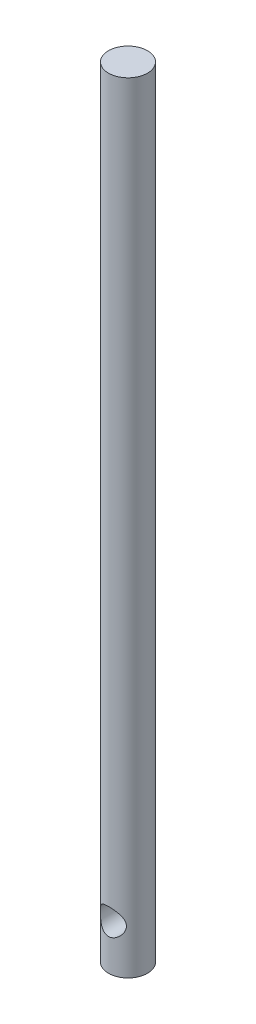
ISO-10303-21;
HEADER;
FILE_DESCRIPTION(('STEP AP214'),'2;1');
FILE_NAME('part.step','',(''),(''),'','','');
FILE_SCHEMA(('AUTOMOTIVE_DESIGN { 1 0 10303 214 1 1 1 1 }'));
ENDSEC;
DATA;
#1=APPLICATION_CONTEXT('core data for automotive mechanical design processes');
#2=APPLICATION_PROTOCOL_DEFINITION('international standard','automotive_design',2000,#1);
#3=PRODUCT_CONTEXT('',#1,'mechanical');
#4=PRODUCT('Part','Part','',(#3));
#5=PRODUCT_RELATED_PRODUCT_CATEGORY('part','',(#4));
#6=PRODUCT_DEFINITION_FORMATION('','',#4);
#7=PRODUCT_DEFINITION_CONTEXT('part definition',#1,'design');
#8=PRODUCT_DEFINITION('design','',#6,#7);
#9=PRODUCT_DEFINITION_SHAPE('','',#8);
#10=(LENGTH_UNIT() NAMED_UNIT(*) SI_UNIT(.MILLI.,.METRE.));
#11=(NAMED_UNIT(*) PLANE_ANGLE_UNIT() SI_UNIT($,.RADIAN.));
#12=(NAMED_UNIT(*) SI_UNIT($,.STERADIAN.) SOLID_ANGLE_UNIT());
#13=UNCERTAINTY_MEASURE_WITH_UNIT(LENGTH_MEASURE(1.E-05),#10,'distance_accuracy_value','');
#14=(GEOMETRIC_REPRESENTATION_CONTEXT(3) GLOBAL_UNCERTAINTY_ASSIGNED_CONTEXT((#13)) GLOBAL_UNIT_ASSIGNED_CONTEXT((#10,
#11,#12)) REPRESENTATION_CONTEXT('',''));
#15=CARTESIAN_POINT('',(0.,0.,0.));
#16=DIRECTION('',(0.,0.,1.));
#17=DIRECTION('',(1.,0.,0.));
#18=AXIS2_PLACEMENT_3D('',#15,#16,#17);
#19=CARTESIAN_POINT('',(0.,60.,0.));
#20=DIRECTION('',(0.,-1.,0.));
#21=DIRECTION('',(0.,0.,-1.));
#22=AXIS2_PLACEMENT_3D('',#19,#20,#21);
#23=CYLINDRICAL_SURFACE('',#22,1.5);
#24=CARTESIAN_POINT('',(0.,4.45868992679093,-1.5));
#25=CARTESIAN_POINT('',(-0.0502423583340646,4.45869020160718,-1.50000020822414));
#26=CARTESIAN_POINT('',(-0.100484543566458,4.45488294181319,-1.49745401376693));
#27=CARTESIAN_POINT('',(-0.199366529015834,4.43989149473811,-1.48752326211906));
#28=CARTESIAN_POINT('',(-0.248005556977502,4.4287038052293,-1.48013640790618));
#29=CARTESIAN_POINT('',(-0.342106153927126,4.39963606812852,-1.46125241202354));
#30=CARTESIAN_POINT('',(-0.387581436328777,4.38178735678697,-1.44977452746657));
#31=CARTESIAN_POINT('',(-0.474707645498628,4.34015824515519,-1.4236306893872));
#32=CARTESIAN_POINT('',(-0.516358015804833,4.31637698364066,-1.40896427302755));
#33=CARTESIAN_POINT('',(-0.598642350385054,4.26136145810723,-1.37613664684919));
#34=CARTESIAN_POINT('',(-0.638890152730338,4.2296659964195,-1.3577844878966));
#35=CARTESIAN_POINT('',(-0.713864022346369,4.16082490246172,-1.31991156541733));
#36=CARTESIAN_POINT('',(-0.748582027719439,4.12367146187207,-1.30038915178416));
#37=CARTESIAN_POINT('',(-0.81711148872748,4.03816374298461,-1.25864132339397));
#38=CARTESIAN_POINT('',(-0.849915931813755,3.98896710018922,-1.23647533968899));
#39=CARTESIAN_POINT('',(-0.906751785070868,3.88450823796767,-1.19542073676408));
#40=CARTESIAN_POINT('',(-0.930798367132494,3.82925672600955,-1.17652647977327));
#41=CARTESIAN_POINT('',(-0.963370175057203,3.73033428008015,-1.14988133320735));
#42=CARTESIAN_POINT('',(-0.974372236180082,3.68792570035404,-1.14048813946218));
#43=CARTESIAN_POINT('',(-0.9907530889261,3.60131767442008,-1.12628984829786));
#44=CARTESIAN_POINT('',(-0.99614157325966,3.55712145242775,-1.12147684372013));
#45=CARTESIAN_POINT('',(-1.00095682070629,3.46795253736287,-1.11718302804083));
#46=CARTESIAN_POINT('',(-1.0003592145882,3.42297741506535,-1.11772401279478));
#47=CARTESIAN_POINT('',(-0.993187906666195,3.33387244004047,-1.12409887741485));
#48=CARTESIAN_POINT('',(-0.986609141899784,3.28974333577463,-1.12993724142592));
#49=CARTESIAN_POINT('',(-0.968324971088712,3.20545640117215,-1.14563592995791));
#50=CARTESIAN_POINT('',(-0.956858557405004,3.16520925882942,-1.15530744165153));
#51=CARTESIAN_POINT('',(-0.929350592909502,3.08717808129519,-1.17754811463845));
#52=CARTESIAN_POINT('',(-0.913307536614355,3.04939486164231,-1.19011822916388));
#53=CARTESIAN_POINT('',(-0.873369093698319,2.9691772291498,-1.21982098202212));
#54=CARTESIAN_POINT('',(-0.848540261643843,2.92735997669689,-1.23736158924507));
#55=CARTESIAN_POINT('',(-0.79334480233653,2.84799822929904,-1.27345768922483));
#56=CARTESIAN_POINT('',(-0.762971345040339,2.81045909795382,-1.29201441370946));
#57=CARTESIAN_POINT('',(-0.689905826559711,2.73241865393538,-1.33271671862095));
#58=CARTESIAN_POINT('',(-0.6459696914045,2.69302290243524,-1.35477372355024));
#59=CARTESIAN_POINT('',(-0.551003999553811,2.62209167953601,-1.39609050337856));
#60=CARTESIAN_POINT('',(-0.499981149675165,2.5905488540899,-1.41535288825285));
#61=CARTESIAN_POINT('',(-0.402428913545602,2.54195106747674,-1.44572702044166));
#62=CARTESIAN_POINT('',(-0.356978821685243,2.52326824512073,-1.45769630582498));
#63=CARTESIAN_POINT('',(-0.263018021968456,2.492637463979,-1.47753859515521));
#64=CARTESIAN_POINT('',(-0.21450993950102,2.48068381322503,-1.48541506063844));
#65=CARTESIAN_POINT('',(-0.115492726585949,2.46410934417175,-1.49637941078331));
#66=CARTESIAN_POINT('',(-0.064975905967025,2.45952019632176,-1.49944661230576));
#67=CARTESIAN_POINT('',(0.0362207596946156,2.45806638250989,-1.50041557482591));
#68=CARTESIAN_POINT('',(0.0869005930932806,2.46120117654655,-1.49831769692815));
#69=CARTESIAN_POINT('',(0.183227858602146,2.47450195457192,-1.48949794712138));
#70=CARTESIAN_POINT('',(0.228978722339654,2.48415857566861,-1.48311123195135));
#71=CARTESIAN_POINT('',(0.318058196213639,2.50948776979732,-1.46659224642396));
#72=CARTESIAN_POINT('',(0.361386418785354,2.52516130225484,-1.45645937873408));
#73=CARTESIAN_POINT('',(0.44733237523322,2.56301607531362,-1.4324817626467));
#74=CARTESIAN_POINT('',(0.489748092316562,2.5855340038327,-1.41844935068245));
#75=CARTESIAN_POINT('',(0.570341511977788,2.63590657176325,-1.38800927805403));
#76=CARTESIAN_POINT('',(0.608516574097253,2.66376450705391,-1.37160015200651));
#77=CARTESIAN_POINT('',(0.685927227415322,2.72899386087331,-1.33477273328243));
#78=CARTESIAN_POINT('',(0.724375937862664,2.76717305684296,-1.31413078406203));
#79=CARTESIAN_POINT('',(0.794669840332392,2.84924564175501,-1.27285586536854));
#80=CARTESIAN_POINT('',(0.826510468230433,2.89314294629034,-1.25222291185946));
#81=CARTESIAN_POINT('',(0.880623882794763,2.98226113322014,-1.21469839506517));
#82=CARTESIAN_POINT('',(0.903478180804393,3.0270559436908,-1.19763798588662));
#83=CARTESIAN_POINT('',(0.942481068876251,3.12062625318151,-1.16719487207113));
#84=CARTESIAN_POINT('',(0.958641728453858,3.16939439598864,-1.1538055628277));
#85=CARTESIAN_POINT('',(0.981179217293118,3.26097217035799,-1.13466604076532));
#86=CARTESIAN_POINT('',(0.988792987823092,3.30327583172041,-1.12797499006895));
#87=CARTESIAN_POINT('',(0.998496029624887,3.38897656745866,-1.11939733222928));
#88=CARTESIAN_POINT('',(1.00059130142516,3.43237240236418,-1.11750550674066));
#89=CARTESIAN_POINT('',(0.999119609907757,3.5190114551493,-1.11882100574833));
#90=CARTESIAN_POINT('',(0.995549293852657,3.5622545674724,-1.12203134956833));
#91=CARTESIAN_POINT('',(0.982984986109971,3.64736169106243,-1.1330522619864));
#92=CARTESIAN_POINT('',(0.973983758587651,3.68922378372133,-1.14086896751217));
#93=CARTESIAN_POINT('',(0.947965178356309,3.78154552000526,-1.1626342196827));
#94=CARTESIAN_POINT('',(0.929450935941994,3.83132378316047,-1.17766166854602));
#95=CARTESIAN_POINT('',(0.885422631474875,3.92643334388035,-1.21111080629161));
#96=CARTESIAN_POINT('',(0.859898741785422,3.97175827575937,-1.22953724861882));
#97=CARTESIAN_POINT('',(0.801991402694659,4.05833087038778,-1.26808593269725));
#98=CARTESIAN_POINT('',(0.769491549448273,4.0994892995102,-1.2882329369107));
#99=CARTESIAN_POINT('',(0.69835884017731,4.17635116591217,-1.32814150773993));
#100=CARTESIAN_POINT('',(0.659724105134953,4.21205292530335,-1.3479029541764));
#101=CARTESIAN_POINT('',(0.57072866487777,4.282045978948,-1.38815775980392));
#102=CARTESIAN_POINT('',(0.519480834775988,4.31539924688077,-1.40834902724558));
#103=CARTESIAN_POINT('',(0.410434277887491,4.37264656512293,-1.44388832937518));
#104=CARTESIAN_POINT('',(0.352646031225024,4.39655548020276,-1.45924396722731));
#105=CARTESIAN_POINT('',(0.245717534917527,4.42926721587296,-1.48050822418367));
#106=CARTESIAN_POINT('',(0.197506162628869,4.44024544634029,-1.48775740184446));
#107=CARTESIAN_POINT('',(0.0995290060120672,4.45495394305996,-1.49750140070948));
#108=CARTESIAN_POINT('',(0.0497644180940296,4.45868965458893,-1.49999979375663));
#109=CARTESIAN_POINT('',(0.,4.45868992679093,-1.5));
#110=B_SPLINE_CURVE_WITH_KNOTS('',3,(#24,#25,#26,#27,#28,#29,#30,#31,#32,#33,#34,#35,#36,#37,
#38,#39,#40,#41,#42,#43,#44,#45,#46,#47,#48,#49,#50,#51,#52,#53,#54,#55,#56,#57,#58,#59,#60,#61,
#62,#63,#64,#65,#66,#67,#68,#69,#70,#71,#72,#73,#74,#75,#76,#77,#78,#79,#80,#81,#82,#83,#84,#85,
#86,#87,#88,#89,#90,#91,#92,#93,#94,#95,#96,#97,#98,#99,#100,#101,#102,#103,#104,#105,#106,#107,
#108,#109),.UNSPECIFIED.,.T.,.F.,(4,2,2,2,2,2,2,2,2,2,2,2,2,2,2,2,2,2,2,2,2,2,2,2,2,2,2,2,2,2,2,
2,2,2,2,2,2,2,2,2,2,2,4),(0.,0.1505266132527,0.301124707174343,0.451023076595114,
0.600943219336931,0.763585145002783,0.926462058021591,1.11503341647991,1.30327652722719,
1.43716846838014,1.57082883922904,1.70503355867689,1.83935198631676,1.96774431099011,
2.09617891902539,2.25073787329796,2.40548851889212,2.5935947724756,2.78152420149865,
2.93262043847563,3.0835886757059,3.23520441646309,3.38680955765891,3.5277654239542,
3.66874377568319,3.81826173413942,3.96787227471785,4.14114088069829,4.31452876587063,
4.473249676497,4.63168313315305,4.76162024003011,4.8914160016149,5.02128860137217,
5.15133461921144,5.31603304346011,5.48096356682587,5.64889622595852,5.81688041978686,
6.00897675773024,6.20076953274023,6.34997645676982,6.49907115623394),.UNSPECIFIED.);
#111=CARTESIAN_POINT('',(0.,4.45868992679093,-1.5));
#112=VERTEX_POINT('',#111);
#113=EDGE_CURVE('E10',#112,#112,#110,.T.);
#114=ORIENTED_EDGE('',*,*,#113,.T.);
#115=EDGE_LOOP('',(#114));
#116=FACE_BOUND('',#115,.T.);
#117=CARTESIAN_POINT('',(1.,3.45868992679094,1.1180339887499));
#118=CARTESIAN_POINT('',(0.999997269988655,3.40987577135663,1.11803876731408));
#119=CARTESIAN_POINT('',(0.99639496251832,3.36104454993654,1.12129035523721));
#120=CARTESIAN_POINT('',(0.982291341588655,3.26512997096554,1.13365986250808));
#121=CARTESIAN_POINT('',(0.971777652939311,3.21804990902616,1.14278830406355));
#122=CARTESIAN_POINT('',(0.94467930838316,3.1273222058521,1.16528292912785));
#123=CARTESIAN_POINT('',(0.92815359007107,3.08364607842211,1.17860780897301));
#124=CARTESIAN_POINT('',(0.889670041967692,2.99975701061761,1.20792047340913));
#125=CARTESIAN_POINT('',(0.867711084060814,2.95954479180271,1.22390881079415));
#126=CARTESIAN_POINT('',(0.815012050038568,2.87686648298249,1.25973036466013));
#127=CARTESIAN_POINT('',(0.783437177258661,2.83502386793235,1.27977468045182));
#128=CARTESIAN_POINT('',(0.7140960987034,2.7566885723538,1.31972413654041));
#129=CARTESIAN_POINT('',(0.676323865885401,2.72020116596168,1.33962912148992));
#130=CARTESIAN_POINT('',(0.589078452471478,2.64836809740011,1.38044409261874));
#131=CARTESIAN_POINT('',(0.538703219829095,2.61394867090311,1.40108392923461));
#132=CARTESIAN_POINT('',(0.431235482106116,2.55436887904591,1.43779242241382));
#133=CARTESIAN_POINT('',(0.374150576160852,2.52919816977535,1.45386618115518));
#134=CARTESIAN_POINT('',(0.261624536740001,2.49191172628222,1.47799953732363));
#135=CARTESIAN_POINT('',(0.206717362590708,2.47864825454316,1.48675587807934));
#136=CARTESIAN_POINT('',(0.0948477243649308,2.46159768214912,1.49804872730961));
#137=CARTESIAN_POINT('',(0.0378879406429124,2.45779864717822,1.5005930688118));
#138=CARTESIAN_POINT('',(-0.0670735251161647,2.45977615176547,1.49927680861477));
#139=CARTESIAN_POINT('',(-0.115120319004376,2.46418445244947,1.49633132455064));
#140=CARTESIAN_POINT('',(-0.209619316635508,2.4797354524704,1.4860409139501));
#141=CARTESIAN_POINT('',(-0.256071403824862,2.49087864294271,1.47869566656551));
#142=CARTESIAN_POINT('',(-0.346038968835585,2.51928776918823,1.46026045851868));
#143=CARTESIAN_POINT('',(-0.389565311922981,2.53652936939022,1.44918538991339));
#144=CARTESIAN_POINT('',(-0.473104575326778,2.57646674826735,1.42410552238144));
#145=CARTESIAN_POINT('',(-0.513116852484701,2.5991635225417,1.41010018872581));
#146=CARTESIAN_POINT('',(-0.59414214598172,2.65267929552089,1.37809029225351));
#147=CARTESIAN_POINT('',(-0.634595740498539,2.68417368846734,1.35980204396012));
#148=CARTESIAN_POINT('',(-0.709994037491523,2.75263926653111,1.32200300913499));
#149=CARTESIAN_POINT('',(-0.744930067597285,2.78961889975785,1.30249036407615));
#150=CARTESIAN_POINT('',(-0.813861176630827,2.87467153189759,1.26075022472076));
#151=CARTESIAN_POINT('',(-0.846867965631777,2.92357546664818,1.23857160004468));
#152=CARTESIAN_POINT('',(-0.904174374727408,3.02744484640131,1.19737805415546));
#153=CARTESIAN_POINT('',(-0.928488593274471,3.08239992399791,1.17835785767438));
#154=CARTESIAN_POINT('',(-0.961663622838891,3.18104945782748,1.15131435153449));
#155=CARTESIAN_POINT('',(-0.972953958737704,3.22348661181934,1.1417018228885));
#156=CARTESIAN_POINT('',(-0.989897777900029,3.3102096716994,1.1270451989479));
#157=CARTESIAN_POINT('',(-0.995561034821825,3.35449223237741,1.12199318391119));
#158=CARTESIAN_POINT('',(-1.00089700074453,3.44391142001154,1.11723778493745));
#159=CARTESIAN_POINT('',(-1.00054364876605,3.48905091605043,1.11755766933454));
#160=CARTESIAN_POINT('',(-0.993808148581262,3.57853184376904,1.12354940184257));
#161=CARTESIAN_POINT('',(-0.987421113449806,3.6228725988468,1.12922558823607));
#162=CARTESIAN_POINT('',(-0.969499055937226,3.7073846355638,1.14463988751152));
#163=CARTESIAN_POINT('',(-0.958230872657146,3.74765378128472,1.15416593537715));
#164=CARTESIAN_POINT('',(-0.931115208135282,3.8257530448236,1.17614979263984));
#165=CARTESIAN_POINT('',(-0.915266188999619,3.86358233830044,1.18860858636727));
#166=CARTESIAN_POINT('',(-0.875816733031264,3.94379092867932,1.21805741810736));
#167=CARTESIAN_POINT('',(-0.851300144226032,3.98556833242189,1.23545540768822));
#168=CARTESIAN_POINT('',(-0.796763657645591,4.06489832795592,1.27131257456476));
#169=CARTESIAN_POINT('',(-0.76673705945938,4.10244568512036,1.2897730248931));
#170=CARTESIAN_POINT('',(-0.694383288512649,4.18067110057618,1.33037839141598));
#171=CARTESIAN_POINT('',(-0.650801932557864,4.22024135092879,1.35244726064259));
#172=CARTESIAN_POINT('',(-0.556549744344256,4.29159826824741,1.39387790925842));
#173=CARTESIAN_POINT('',(-0.505885238731678,4.32339181241601,1.41324207395941));
#174=CARTESIAN_POINT('',(-0.408743737408334,4.37263579625241,1.44395410620131));
#175=CARTESIAN_POINT('',(-0.363331182442474,4.39166817901184,1.45612729055242));
#176=CARTESIAN_POINT('',(-0.269378539510946,4.42299352395045,1.47639353933783));
#177=CARTESIAN_POINT('',(-0.22084113192957,4.43529217822064,1.48449004936067));
#178=CARTESIAN_POINT('',(-0.121684696151538,4.45253840871051,1.49589182013302));
#179=CARTESIAN_POINT('',(-0.0710574184621112,4.45745326654433,1.49917575428247));
#180=CARTESIAN_POINT('',(0.0304277732903151,4.45951385249944,1.50054910514547));
#181=CARTESIAN_POINT('',(0.0812856654767098,4.45666030276902,1.49863900469456));
#182=CARTESIAN_POINT('',(0.177878766264064,4.44386018228861,1.49014777988657));
#183=CARTESIAN_POINT('',(0.223717571535268,4.43444443436004,1.48391638604927));
#184=CARTESIAN_POINT('',(0.313009211498527,4.40957092207549,1.46768053103468));
#185=CARTESIAN_POINT('',(0.356461674343444,4.39411221911731,1.45767548373552));
#186=CARTESIAN_POINT('',(0.442573648304176,4.35672057434893,1.43395882743097));
#187=CARTESIAN_POINT('',(0.485041794600132,4.3344647730434,1.42006624473169));
#188=CARTESIAN_POINT('',(0.56577633134159,4.28461460447795,1.38987704117736));
#189=CARTESIAN_POINT('',(0.604040186025009,4.25701704281494,1.37357898322632));
#190=CARTESIAN_POINT('',(0.681647111007009,4.19237547562279,1.33696465736197));
#191=CARTESIAN_POINT('',(0.720213397630455,4.15452841495392,1.31641956938685));
#192=CARTESIAN_POINT('',(0.790800111407977,4.07313315601802,1.27526678824743));
#193=CARTESIAN_POINT('',(0.822815641619615,4.0295807323739,1.25465905985077));
#194=CARTESIAN_POINT('',(0.877566267592055,3.9407561314133,1.21692106795149));
#195=CARTESIAN_POINT('',(0.90082323448605,3.89586902181577,1.19964543370952));
#196=CARTESIAN_POINT('',(0.940579011701362,3.80204770229436,1.16873750795511));
#197=CARTESIAN_POINT('',(0.957090951406665,3.75312157985987,1.15509815647652));
#198=CARTESIAN_POINT('',(0.979681312354539,3.66330419257867,1.1359552596477));
#199=CARTESIAN_POINT('',(0.987261141866241,3.62303580839579,1.12931847705076));
#200=CARTESIAN_POINT('',(0.997419579094631,3.54141172653867,1.12035759608004));
#201=CARTESIAN_POINT('',(1.00000231351858,3.50005695466065,1.11802993920738));
#202=CARTESIAN_POINT('',(1.,3.45868992679094,1.1180339887499));
#203=B_SPLINE_CURVE_WITH_KNOTS('',3,(#117,#118,#119,#120,#121,#122,#123,#124,#125,#126,#127,
#128,#129,#130,#131,#132,#133,#134,#135,#136,#137,#138,#139,#140,#141,#142,#143,#144,#145,#146,
#147,#148,#149,#150,#151,#152,#153,#154,#155,#156,#157,#158,#159,#160,#161,#162,#163,#164,#165,
#166,#167,#168,#169,#170,#171,#172,#173,#174,#175,#176,#177,#178,#179,#180,#181,#182,#183,#184,
#185,#186,#187,#188,#189,#190,#191,#192,#193,#194,#195,#196,#197,#198,#199,#200,#201,#202),
.UNSPECIFIED.,.T.,.F.,(4,2,2,2,2,2,2,2,2,2,2,2,2,2,2,2,2,2,2,2,2,2,2,2,2,2,2,2,2,2,2,2,2,2,2,2,
2,2,2,2,2,2,4),(0.,0.146253465361076,0.292769521129644,0.437886325608136,0.583033286332744,
0.750773385343187,0.918677592181376,1.11083515503145,1.3027771469429,1.4731874103179,
1.64338268344149,1.78769767477871,1.93202319141873,2.07577915986595,2.219561384515,
2.38223762973317,2.54516707398319,2.73339351752472,2.92130234871974,3.05563045200662,
3.18972483117743,3.32440018819018,3.45918471785299,3.58738225853468,3.71562288822479,
3.86949615025543,4.0235577839993,4.21127342259657,4.39882245285466,4.55035290305024,
4.70175506443411,4.85382614632258,5.00588309222248,5.1468839112404,5.28790663945594,
5.43708931492125,5.58636147964719,5.75911103141433,5.93198925208477,6.09167062897535,
6.25103968323788,6.37508308151303,6.49902399831892),.UNSPECIFIED.);
#204=CARTESIAN_POINT('',(1.,3.45868992679094,1.1180339887499));
#205=VERTEX_POINT('',#204);
#206=EDGE_CURVE('E53',#205,#205,#203,.T.);
#207=ORIENTED_EDGE('',*,*,#206,.T.);
#208=EDGE_LOOP('',(#207));
#209=FACE_BOUND('',#208,.T.);
#210=CARTESIAN_POINT('',(0.,60.,0.));
#211=DIRECTION('',(0.,1.,0.));
#212=DIRECTION('',(0.,0.,1.));
#213=AXIS2_PLACEMENT_3D('',#210,#211,#212);
#214=CIRCLE('',#213,1.5);
#215=CARTESIAN_POINT('',(0.,60.,1.5));
#216=VERTEX_POINT('',#215);
#217=EDGE_CURVE('E58',#216,#216,#214,.T.);
#218=ORIENTED_EDGE('',*,*,#217,.F.);
#219=EDGE_LOOP('',(#218));
#220=FACE_BOUND('',#219,.T.);
#221=CARTESIAN_POINT('',(0.,0.,0.));
#222=DIRECTION('',(0.,1.,0.));
#223=DIRECTION('',(0.,0.,1.));
#224=AXIS2_PLACEMENT_3D('',#221,#222,#223);
#225=CIRCLE('',#224,1.5);
#226=CARTESIAN_POINT('',(0.,0.,1.5));
#227=VERTEX_POINT('',#226);
#228=EDGE_CURVE('E63',#227,#227,#225,.T.);
#229=ORIENTED_EDGE('',*,*,#228,.T.);
#230=EDGE_LOOP('',(#229));
#231=FACE_BOUND('',#230,.T.);
#232=ADVANCED_FACE('F41',(#116,#209,#220,#231),#23,.T.);
#233=CARTESIAN_POINT('',(0.,60.,0.));
#234=DIRECTION('',(0.,1.,0.));
#235=DIRECTION('',(0.,0.,1.));
#236=AXIS2_PLACEMENT_3D('',#233,#234,#235);
#237=PLANE('',#236);
#238=ORIENTED_EDGE('',*,*,#217,.T.);
#239=EDGE_LOOP('',(#238));
#240=FACE_BOUND('',#239,.T.);
#241=ADVANCED_FACE('F75',(#240),#237,.T.);
#242=CARTESIAN_POINT('',(0.,0.,0.));
#243=DIRECTION('',(0.,1.,0.));
#244=DIRECTION('',(0.,0.,1.));
#245=AXIS2_PLACEMENT_3D('',#242,#243,#244);
#246=PLANE('',#245);
#247=ORIENTED_EDGE('',*,*,#228,.F.);
#248=EDGE_LOOP('',(#247));
#249=FACE_BOUND('',#248,.T.);
#250=ADVANCED_FACE('F73',(#249),#246,.F.);
#251=CARTESIAN_POINT('',(0.,3.45868992679094,-1.5));
#252=DIRECTION('',(0.,0.,1.));
#253=DIRECTION('',(1.,0.,0.));
#254=AXIS2_PLACEMENT_3D('',#251,#252,#253);
#255=CYLINDRICAL_SURFACE('',#254,1.);
#256=ORIENTED_EDGE('',*,*,#206,.F.);
#257=EDGE_LOOP('',(#256));
#258=FACE_BOUND('',#257,.T.);
#259=ORIENTED_EDGE('',*,*,#113,.F.);
#260=EDGE_LOOP('',(#259));
#261=FACE_BOUND('',#260,.T.);
#262=ADVANCED_FACE('F69',(#258,#261),#255,.F.);
#263=CLOSED_SHELL('',(#232,#241,#250,#262));
#264=MANIFOLD_SOLID_BREP('B2',#263);
#265=ADVANCED_BREP_SHAPE_REPRESENTATION('',(#18,#264),#14);
#266=SHAPE_DEFINITION_REPRESENTATION(#9,#265);
ENDSEC;
END-ISO-10303-21;
